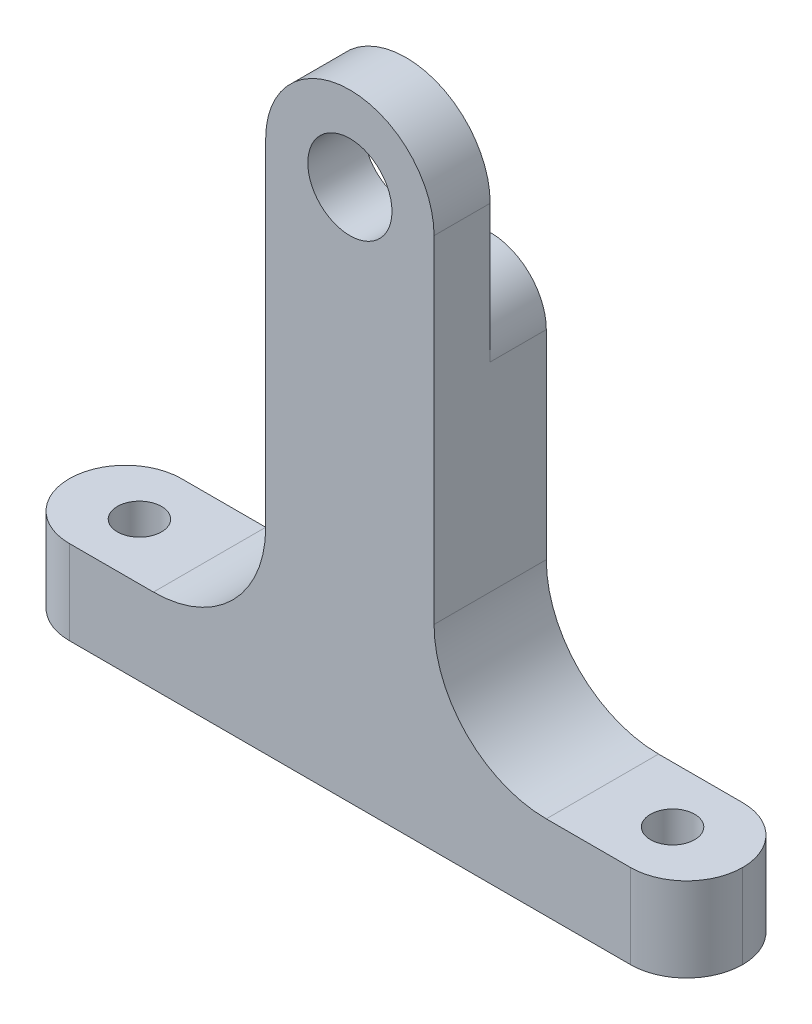
ISO-10303-21;
HEADER;
FILE_DESCRIPTION(('STEP AP214'),'2;1');
FILE_NAME('part.step','',(''),(''),'','','');
FILE_SCHEMA(('AUTOMOTIVE_DESIGN { 1 0 10303 214 1 1 1 1 }'));
ENDSEC;
DATA;
#1=APPLICATION_CONTEXT('core data for automotive mechanical design processes');
#2=APPLICATION_PROTOCOL_DEFINITION('international standard','automotive_design',2000,#1);
#3=PRODUCT_CONTEXT('',#1,'mechanical');
#4=PRODUCT('Part','Part','',(#3));
#5=PRODUCT_RELATED_PRODUCT_CATEGORY('part','',(#4));
#6=PRODUCT_DEFINITION_FORMATION('','',#4);
#7=PRODUCT_DEFINITION_CONTEXT('part definition',#1,'design');
#8=PRODUCT_DEFINITION('design','',#6,#7);
#9=PRODUCT_DEFINITION_SHAPE('','',#8);
#10=(LENGTH_UNIT() NAMED_UNIT(*) SI_UNIT(.MILLI.,.METRE.));
#11=(NAMED_UNIT(*) PLANE_ANGLE_UNIT() SI_UNIT($,.RADIAN.));
#12=(NAMED_UNIT(*) SI_UNIT($,.STERADIAN.) SOLID_ANGLE_UNIT());
#13=UNCERTAINTY_MEASURE_WITH_UNIT(LENGTH_MEASURE(1.E-05),#10,'distance_accuracy_value','');
#14=(GEOMETRIC_REPRESENTATION_CONTEXT(3) GLOBAL_UNCERTAINTY_ASSIGNED_CONTEXT((#13)) GLOBAL_UNIT_ASSIGNED_CONTEXT((#10,
#11,#12)) REPRESENTATION_CONTEXT('',''));
#15=CARTESIAN_POINT('',(0.,0.,0.));
#16=DIRECTION('',(0.,0.,1.));
#17=DIRECTION('',(1.,0.,0.));
#18=AXIS2_PLACEMENT_3D('',#15,#16,#17);
#19=CARTESIAN_POINT('',(9.525,0.,12.7));
#20=DIRECTION('',(1.,0.,0.));
#21=DIRECTION('',(0.,1.,0.));
#22=AXIS2_PLACEMENT_3D('',#19,#20,#21);
#23=PLANE('',#22);
#24=DIRECTION('',(0.,-1.,0.));
#25=VECTOR('',#24,1.);
#26=CARTESIAN_POINT('',(9.525,0.,0.));
#27=LINE('',#26,#25);
#28=CARTESIAN_POINT('',(9.525,-15.5542598666732,0.));
#29=VERTEX_POINT('',#28);
#30=CARTESIAN_POINT('',(9.525,-38.1,0.));
#31=VERTEX_POINT('',#30);
#32=EDGE_CURVE('E203',#29,#31,#27,.T.);
#33=ORIENTED_EDGE('',*,*,#32,.F.);
#34=DIRECTION('',(0.,0.,1.));
#35=VECTOR('',#34,1.);
#36=CARTESIAN_POINT('',(9.525,-15.5542598666732,6.35000000000002));
#37=LINE('',#36,#35);
#38=CARTESIAN_POINT('',(9.525,-15.5542598666732,6.35));
#39=VERTEX_POINT('',#38);
#40=EDGE_CURVE('E158',#29,#39,#37,.T.);
#41=ORIENTED_EDGE('',*,*,#40,.T.);
#42=DIRECTION('',(0.,1.,0.));
#43=VECTOR('',#42,1.);
#44=CARTESIAN_POINT('',(9.525,0.,6.35));
#45=LINE('',#44,#43);
#46=CARTESIAN_POINT('',(9.525,0.,6.35));
#47=VERTEX_POINT('',#46);
#48=EDGE_CURVE('E63',#39,#47,#45,.T.);
#49=ORIENTED_EDGE('',*,*,#48,.T.);
#50=DIRECTION('',(0.,0.,-1.));
#51=VECTOR('',#50,1.);
#52=CARTESIAN_POINT('',(9.525,0.,12.7));
#53=LINE('',#52,#51);
#54=CARTESIAN_POINT('',(9.525,0.,12.7));
#55=VERTEX_POINT('',#54);
#56=EDGE_CURVE('E155',#55,#47,#53,.T.);
#57=ORIENTED_EDGE('',*,*,#56,.F.);
#58=DIRECTION('',(0.,-1.,0.));
#59=VECTOR('',#58,1.);
#60=CARTESIAN_POINT('',(9.525,0.,12.7));
#61=LINE('',#60,#59);
#62=CARTESIAN_POINT('',(9.525,-38.1,12.7));
#63=VERTEX_POINT('',#62);
#64=EDGE_CURVE('E285',#55,#63,#61,.T.);
#65=ORIENTED_EDGE('',*,*,#64,.T.);
#66=DIRECTION('',(0.,0.,-1.));
#67=VECTOR('',#66,1.);
#68=CARTESIAN_POINT('',(9.525,-38.1,12.7));
#69=LINE('',#68,#67);
#70=EDGE_CURVE('E183',#63,#31,#69,.T.);
#71=ORIENTED_EDGE('',*,*,#70,.T.);
#72=EDGE_LOOP('',(#33,#41,#49,#57,#65,#71));
#73=FACE_BOUND('',#72,.T.);
#74=ADVANCED_FACE('F43',(#73),#23,.T.);
#75=CARTESIAN_POINT('',(0.,0.,12.7));
#76=DIRECTION('',(0.,0.,-1.));
#77=DIRECTION('',(-1.,0.,0.));
#78=AXIS2_PLACEMENT_3D('',#75,#76,#77);
#79=CYLINDRICAL_SURFACE('',#78,9.525);
#80=ORIENTED_EDGE('',*,*,#56,.T.);
#81=CARTESIAN_POINT('',(0.,0.,6.35));
#82=DIRECTION('',(0.,0.,1.));
#83=DIRECTION('',(1.,0.,0.));
#84=AXIS2_PLACEMENT_3D('',#81,#82,#83);
#85=CIRCLE('',#84,9.525);
#86=CARTESIAN_POINT('',(-9.525,0.,6.35));
#87=VERTEX_POINT('',#86);
#88=EDGE_CURVE('E163',#87,#47,#85,.F.);
#89=ORIENTED_EDGE('',*,*,#88,.F.);
#90=DIRECTION('',(0.,0.,-1.));
#91=VECTOR('',#90,1.);
#92=CARTESIAN_POINT('',(-9.525,0.,12.7));
#93=LINE('',#92,#91);
#94=CARTESIAN_POINT('',(-9.525,0.,12.7));
#95=VERTEX_POINT('',#94);
#96=EDGE_CURVE('E173',#95,#87,#93,.T.);
#97=ORIENTED_EDGE('',*,*,#96,.F.);
#98=CARTESIAN_POINT('',(0.,0.,12.7));
#99=DIRECTION('',(0.,0.,1.));
#100=DIRECTION('',(1.,0.,0.));
#101=AXIS2_PLACEMENT_3D('',#98,#99,#100);
#102=CIRCLE('',#101,9.525);
#103=EDGE_CURVE('E170',#55,#95,#102,.T.);
#104=ORIENTED_EDGE('',*,*,#103,.F.);
#105=EDGE_LOOP('',(#80,#89,#97,#104));
#106=FACE_BOUND('',#105,.T.);
#107=ADVANCED_FACE('F169',(#106),#79,.T.);
#108=CARTESIAN_POINT('',(-9.525,0.,12.7));
#109=DIRECTION('',(1.,0.,0.));
#110=DIRECTION('',(0.,1.,0.));
#111=AXIS2_PLACEMENT_3D('',#108,#109,#110);
#112=PLANE('',#111);
#113=DIRECTION('',(0.,-1.,0.));
#114=VECTOR('',#113,1.);
#115=CARTESIAN_POINT('',(-9.525,0.,6.35));
#116=LINE('',#115,#114);
#117=CARTESIAN_POINT('',(-9.525,-15.5542598666732,6.35));
#118=VERTEX_POINT('',#117);
#119=EDGE_CURVE('E58',#87,#118,#116,.T.);
#120=ORIENTED_EDGE('',*,*,#119,.T.);
#121=DIRECTION('',(0.,0.,-1.));
#122=VECTOR('',#121,1.);
#123=CARTESIAN_POINT('',(-9.525,-15.5542598666732,12.7));
#124=LINE('',#123,#122);
#125=CARTESIAN_POINT('',(-9.525,-15.5542598666732,0.));
#126=VERTEX_POINT('',#125);
#127=EDGE_CURVE('E242',#118,#126,#124,.T.);
#128=ORIENTED_EDGE('',*,*,#127,.T.);
#129=DIRECTION('',(0.,-1.,0.));
#130=VECTOR('',#129,1.);
#131=CARTESIAN_POINT('',(-9.525,0.,0.));
#132=LINE('',#131,#130);
#133=CARTESIAN_POINT('',(-9.525,-38.1,0.));
#134=VERTEX_POINT('',#133);
#135=EDGE_CURVE('E267',#126,#134,#132,.T.);
#136=ORIENTED_EDGE('',*,*,#135,.T.);
#137=DIRECTION('',(0.,0.,-1.));
#138=VECTOR('',#137,1.);
#139=CARTESIAN_POINT('',(-9.525,-38.1,12.7));
#140=LINE('',#139,#138);
#141=CARTESIAN_POINT('',(-9.525,-38.1,12.7));
#142=VERTEX_POINT('',#141);
#143=EDGE_CURVE('E176',#134,#142,#140,.F.);
#144=ORIENTED_EDGE('',*,*,#143,.T.);
#145=DIRECTION('',(0.,-1.,0.));
#146=VECTOR('',#145,1.);
#147=CARTESIAN_POINT('',(-9.525,0.,12.7));
#148=LINE('',#147,#146);
#149=EDGE_CURVE('E289',#95,#142,#148,.T.);
#150=ORIENTED_EDGE('',*,*,#149,.F.);
#151=ORIENTED_EDGE('',*,*,#96,.T.);
#152=EDGE_LOOP('',(#120,#128,#136,#144,#150,#151));
#153=FACE_BOUND('',#152,.T.);
#154=ADVANCED_FACE('F260',(#153),#112,.F.);
#155=CARTESIAN_POINT('',(0.,-50.8,12.7));
#156=DIRECTION('',(0.,-1.,0.));
#157=DIRECTION('',(1.,0.,0.));
#158=AXIS2_PLACEMENT_3D('',#155,#156,#157);
#159=PLANE('',#158);
#160=CARTESIAN_POINT('',(-30.1625,-50.8,6.35));
#161=DIRECTION('',(0.,1.,0.));
#162=DIRECTION('',(-1.,0.,0.));
#163=AXIS2_PLACEMENT_3D('',#160,#161,#162);
#164=CIRCLE('',#163,2.5);
#165=CARTESIAN_POINT('',(-32.6625,-50.8,6.35));
#166=VERTEX_POINT('',#165);
#167=EDGE_CURVE('E234',#166,#166,#164,.T.);
#168=ORIENTED_EDGE('',*,*,#167,.F.);
#169=EDGE_LOOP('',(#168));
#170=FACE_BOUND('',#169,.T.);
#171=CARTESIAN_POINT('',(-31.75,-50.8,6.35));
#172=DIRECTION('',(0.,-1.,0.));
#173=DIRECTION('',(1.,0.,0.));
#174=AXIS2_PLACEMENT_3D('',#171,#172,#173);
#175=CIRCLE('',#174,6.35);
#176=CARTESIAN_POINT('',(-31.75,-50.8,0.));
#177=VERTEX_POINT('',#176);
#178=CARTESIAN_POINT('',(-38.1,-50.8,6.35));
#179=VERTEX_POINT('',#178);
#180=EDGE_CURVE('E218',#177,#179,#175,.F.);
#181=ORIENTED_EDGE('',*,*,#180,.T.);
#182=CARTESIAN_POINT('',(-31.75,-50.8,6.35));
#183=DIRECTION('',(0.,-1.,0.));
#184=DIRECTION('',(1.,0.,0.));
#185=AXIS2_PLACEMENT_3D('',#182,#183,#184);
#186=CIRCLE('',#185,6.35);
#187=CARTESIAN_POINT('',(-31.75,-50.8,12.7));
#188=VERTEX_POINT('',#187);
#189=EDGE_CURVE('E220',#179,#188,#186,.F.);
#190=ORIENTED_EDGE('',*,*,#189,.T.);
#191=DIRECTION('',(-1.,0.,0.));
#192=VECTOR('',#191,1.);
#193=CARTESIAN_POINT('',(0.,-50.8,12.7));
#194=LINE('',#193,#192);
#195=CARTESIAN_POINT('',(-22.225,-50.8,12.7));
#196=VERTEX_POINT('',#195);
#197=EDGE_CURVE('E296',#196,#188,#194,.T.);
#198=ORIENTED_EDGE('',*,*,#197,.F.);
#199=DIRECTION('',(0.,0.,-1.));
#200=VECTOR('',#199,1.);
#201=CARTESIAN_POINT('',(-22.225,-50.8,0.));
#202=LINE('',#201,#200);
#203=CARTESIAN_POINT('',(-22.225,-50.8,0.));
#204=VERTEX_POINT('',#203);
#205=EDGE_CURVE('E172',#196,#204,#202,.T.);
#206=ORIENTED_EDGE('',*,*,#205,.T.);
#207=DIRECTION('',(-1.,0.,0.));
#208=VECTOR('',#207,1.);
#209=CARTESIAN_POINT('',(0.,-50.8,0.));
#210=LINE('',#209,#208);
#211=EDGE_CURVE('E275',#204,#177,#210,.T.);
#212=ORIENTED_EDGE('',*,*,#211,.T.);
#213=EDGE_LOOP('',(#181,#190,#198,#206,#212));
#214=FACE_BOUND('',#213,.T.);
#215=ADVANCED_FACE('F384',(#170,#214),#159,.F.);
#216=CARTESIAN_POINT('',(0.,-60.325,12.7));
#217=DIRECTION('',(0.,1.,0.));
#218=DIRECTION('',(0.,0.,1.));
#219=AXIS2_PLACEMENT_3D('',#216,#217,#218);
#220=PLANE('',#219);
#221=CARTESIAN_POINT('',(30.1625,-60.325,6.35));
#222=DIRECTION('',(0.,1.,0.));
#223=DIRECTION('',(0.,0.,1.));
#224=AXIS2_PLACEMENT_3D('',#221,#222,#223);
#225=CIRCLE('',#224,2.49999999999999);
#226=CARTESIAN_POINT('',(30.1625,-60.325,8.84999999999999));
#227=VERTEX_POINT('',#226);
#228=EDGE_CURVE('E204',#227,#227,#225,.T.);
#229=ORIENTED_EDGE('',*,*,#228,.T.);
#230=EDGE_LOOP('',(#229));
#231=FACE_BOUND('',#230,.T.);
#232=CARTESIAN_POINT('',(-30.1625,-60.325,6.35));
#233=DIRECTION('',(0.,1.,0.));
#234=DIRECTION('',(0.,0.,1.));
#235=AXIS2_PLACEMENT_3D('',#232,#233,#234);
#236=CIRCLE('',#235,2.5);
#237=CARTESIAN_POINT('',(-30.1625,-60.325,8.85));
#238=VERTEX_POINT('',#237);
#239=EDGE_CURVE('E200',#238,#238,#236,.T.);
#240=ORIENTED_EDGE('',*,*,#239,.T.);
#241=EDGE_LOOP('',(#240));
#242=FACE_BOUND('',#241,.T.);
#243=DIRECTION('',(1.,0.,0.));
#244=VECTOR('',#243,1.);
#245=CARTESIAN_POINT('',(0.,-60.325,12.7));
#246=LINE('',#245,#244);
#247=CARTESIAN_POINT('',(-31.75,-60.325,12.7));
#248=VERTEX_POINT('',#247);
#249=CARTESIAN_POINT('',(31.75,-60.325,12.7));
#250=VERTEX_POINT('',#249);
#251=EDGE_CURVE('E299',#248,#250,#246,.T.);
#252=ORIENTED_EDGE('',*,*,#251,.F.);
#253=CARTESIAN_POINT('',(-31.75,-60.325,6.35));
#254=DIRECTION('',(0.,1.,0.));
#255=DIRECTION('',(0.,0.,1.));
#256=AXIS2_PLACEMENT_3D('',#253,#254,#255);
#257=CIRCLE('',#256,6.35);
#258=CARTESIAN_POINT('',(-38.1,-60.325,6.35));
#259=VERTEX_POINT('',#258);
#260=EDGE_CURVE('E216',#248,#259,#257,.F.);
#261=ORIENTED_EDGE('',*,*,#260,.T.);
#262=CARTESIAN_POINT('',(-31.75,-60.325,6.35));
#263=DIRECTION('',(0.,1.,0.));
#264=DIRECTION('',(0.,0.,1.));
#265=AXIS2_PLACEMENT_3D('',#262,#263,#264);
#266=CIRCLE('',#265,6.35);
#267=CARTESIAN_POINT('',(-31.75,-60.325,0.));
#268=VERTEX_POINT('',#267);
#269=EDGE_CURVE('E214',#259,#268,#266,.F.);
#270=ORIENTED_EDGE('',*,*,#269,.T.);
#271=DIRECTION('',(1.,0.,0.));
#272=VECTOR('',#271,1.);
#273=CARTESIAN_POINT('',(0.,-60.325,0.));
#274=LINE('',#273,#272);
#275=CARTESIAN_POINT('',(31.75,-60.325,0.));
#276=VERTEX_POINT('',#275);
#277=EDGE_CURVE('E282',#268,#276,#274,.T.);
#278=ORIENTED_EDGE('',*,*,#277,.T.);
#279=CARTESIAN_POINT('',(31.75,-60.325,6.35));
#280=DIRECTION('',(0.,1.,0.));
#281=DIRECTION('',(0.,0.,1.));
#282=AXIS2_PLACEMENT_3D('',#279,#280,#281);
#283=CIRCLE('',#282,6.35);
#284=CARTESIAN_POINT('',(38.1,-60.325,6.35));
#285=VERTEX_POINT('',#284);
#286=EDGE_CURVE('E210',#276,#285,#283,.F.);
#287=ORIENTED_EDGE('',*,*,#286,.T.);
#288=CARTESIAN_POINT('',(31.75,-60.325,6.35));
#289=DIRECTION('',(0.,1.,0.));
#290=DIRECTION('',(0.,0.,1.));
#291=AXIS2_PLACEMENT_3D('',#288,#289,#290);
#292=CIRCLE('',#291,6.35);
#293=EDGE_CURVE('E212',#285,#250,#292,.F.);
#294=ORIENTED_EDGE('',*,*,#293,.T.);
#295=EDGE_LOOP('',(#252,#261,#270,#278,#287,#294));
#296=FACE_BOUND('',#295,.T.);
#297=ADVANCED_FACE('F381',(#231,#242,#296),#220,.F.);
#298=CARTESIAN_POINT('',(0.,-50.8,12.7));
#299=DIRECTION('',(0.,-1.,0.));
#300=DIRECTION('',(1.,0.,0.));
#301=AXIS2_PLACEMENT_3D('',#298,#299,#300);
#302=PLANE('',#301);
#303=CARTESIAN_POINT('',(30.1625,-50.8,6.35));
#304=DIRECTION('',(0.,1.,0.));
#305=DIRECTION('',(-1.,0.,0.));
#306=AXIS2_PLACEMENT_3D('',#303,#304,#305);
#307=CIRCLE('',#306,2.49999999999999);
#308=CARTESIAN_POINT('',(27.6625,-50.8,6.35));
#309=VERTEX_POINT('',#308);
#310=EDGE_CURVE('E419',#309,#309,#307,.T.);
#311=ORIENTED_EDGE('',*,*,#310,.F.);
#312=EDGE_LOOP('',(#311));
#313=FACE_BOUND('',#312,.T.);
#314=DIRECTION('',(-1.,0.,0.));
#315=VECTOR('',#314,1.);
#316=CARTESIAN_POINT('',(0.,-50.8,12.7));
#317=LINE('',#316,#315);
#318=CARTESIAN_POINT('',(31.75,-50.8,12.7));
#319=VERTEX_POINT('',#318);
#320=CARTESIAN_POINT('',(22.225,-50.8,12.7));
#321=VERTEX_POINT('',#320);
#322=EDGE_CURVE('E301',#319,#321,#317,.T.);
#323=ORIENTED_EDGE('',*,*,#322,.F.);
#324=CARTESIAN_POINT('',(31.75,-50.8,6.35));
#325=DIRECTION('',(0.,-1.,0.));
#326=DIRECTION('',(1.,0.,0.));
#327=AXIS2_PLACEMENT_3D('',#324,#325,#326);
#328=CIRCLE('',#327,6.35);
#329=CARTESIAN_POINT('',(38.1,-50.8,6.35));
#330=VERTEX_POINT('',#329);
#331=EDGE_CURVE('E228',#319,#330,#328,.F.);
#332=ORIENTED_EDGE('',*,*,#331,.T.);
#333=CARTESIAN_POINT('',(31.75,-50.8,6.35));
#334=DIRECTION('',(0.,-1.,0.));
#335=DIRECTION('',(1.,0.,0.));
#336=AXIS2_PLACEMENT_3D('',#333,#334,#335);
#337=CIRCLE('',#336,6.35);
#338=CARTESIAN_POINT('',(31.75,-50.8,0.));
#339=VERTEX_POINT('',#338);
#340=EDGE_CURVE('E226',#330,#339,#337,.F.);
#341=ORIENTED_EDGE('',*,*,#340,.T.);
#342=DIRECTION('',(-1.,0.,0.));
#343=VECTOR('',#342,1.);
#344=CARTESIAN_POINT('',(0.,-50.8,0.));
#345=LINE('',#344,#343);
#346=CARTESIAN_POINT('',(22.225,-50.8,0.));
#347=VERTEX_POINT('',#346);
#348=EDGE_CURVE('E284',#339,#347,#345,.T.);
#349=ORIENTED_EDGE('',*,*,#348,.T.);
#350=DIRECTION('',(0.,0.,-1.));
#351=VECTOR('',#350,1.);
#352=CARTESIAN_POINT('',(22.225,-50.8,12.7));
#353=LINE('',#352,#351);
#354=EDGE_CURVE('E186',#347,#321,#353,.F.);
#355=ORIENTED_EDGE('',*,*,#354,.T.);
#356=EDGE_LOOP('',(#323,#332,#341,#349,#355));
#357=FACE_BOUND('',#356,.T.);
#358=ADVANCED_FACE('F320',(#313,#357),#302,.F.);
#359=CARTESIAN_POINT('',(0.,0.,12.7));
#360=DIRECTION('',(0.,0.,-1.));
#361=DIRECTION('',(-1.,0.,0.));
#362=AXIS2_PLACEMENT_3D('',#359,#360,#361);
#363=CYLINDRICAL_SURFACE('',#362,4.7625);
#364=CARTESIAN_POINT('',(0.,0.,6.35));
#365=DIRECTION('',(0.,0.,1.));
#366=DIRECTION('',(1.,0.,0.));
#367=AXIS2_PLACEMENT_3D('',#364,#365,#366);
#368=CIRCLE('',#367,4.7625);
#369=CARTESIAN_POINT('',(4.7625,0.,6.35));
#370=VERTEX_POINT('',#369);
#371=EDGE_CURVE('E238',#370,#370,#368,.T.);
#372=ORIENTED_EDGE('',*,*,#371,.F.);
#373=EDGE_LOOP('',(#372));
#374=FACE_BOUND('',#373,.T.);
#375=CARTESIAN_POINT('',(0.,0.,12.7));
#376=DIRECTION('',(0.,0.,1.));
#377=DIRECTION('',(1.,0.,0.));
#378=AXIS2_PLACEMENT_3D('',#375,#376,#377);
#379=CIRCLE('',#378,4.7625);
#380=CARTESIAN_POINT('',(4.7625,0.,12.7));
#381=VERTEX_POINT('',#380);
#382=EDGE_CURVE('E178',#381,#381,#379,.T.);
#383=ORIENTED_EDGE('',*,*,#382,.T.);
#384=EDGE_LOOP('',(#383));
#385=FACE_BOUND('',#384,.T.);
#386=ADVANCED_FACE('F307',(#374,#385),#363,.F.);
#387=CARTESIAN_POINT('',(0.,0.,12.7));
#388=DIRECTION('',(0.,0.,1.));
#389=DIRECTION('',(1.,0.,0.));
#390=AXIS2_PLACEMENT_3D('',#387,#388,#389);
#391=PLANE('',#390);
#392=ORIENTED_EDGE('',*,*,#197,.T.);
#393=DIRECTION('',(0.,-1.,0.));
#394=VECTOR('',#393,1.);
#395=CARTESIAN_POINT('',(-31.75,-60.325,12.7));
#396=LINE('',#395,#394);
#397=EDGE_CURVE('E207',#188,#248,#396,.T.);
#398=ORIENTED_EDGE('',*,*,#397,.T.);
#399=ORIENTED_EDGE('',*,*,#251,.T.);
#400=DIRECTION('',(0.,1.,0.));
#401=VECTOR('',#400,1.);
#402=CARTESIAN_POINT('',(31.75,-50.8,12.7));
#403=LINE('',#402,#401);
#404=EDGE_CURVE('E199',#250,#319,#403,.T.);
#405=ORIENTED_EDGE('',*,*,#404,.T.);
#406=ORIENTED_EDGE('',*,*,#322,.T.);
#407=CARTESIAN_POINT('',(22.225,-38.1,12.7));
#408=DIRECTION('',(0.,0.,1.));
#409=DIRECTION('',(1.,0.,0.));
#410=AXIS2_PLACEMENT_3D('',#407,#408,#409);
#411=CIRCLE('',#410,12.7);
#412=EDGE_CURVE('E197',#321,#63,#411,.F.);
#413=ORIENTED_EDGE('',*,*,#412,.T.);
#414=ORIENTED_EDGE('',*,*,#64,.F.);
#415=ORIENTED_EDGE('',*,*,#103,.T.);
#416=ORIENTED_EDGE('',*,*,#149,.T.);
#417=CARTESIAN_POINT('',(-22.225,-38.1,12.7));
#418=DIRECTION('',(0.,0.,1.));
#419=DIRECTION('',(1.,0.,0.));
#420=AXIS2_PLACEMENT_3D('',#417,#418,#419);
#421=CIRCLE('',#420,12.7);
#422=EDGE_CURVE('E192',#142,#196,#421,.F.);
#423=ORIENTED_EDGE('',*,*,#422,.T.);
#424=EDGE_LOOP('',(#392,#398,#399,#405,#406,#413,#414,#415,#416,#423));
#425=FACE_BOUND('',#424,.T.);
#426=ORIENTED_EDGE('',*,*,#382,.F.);
#427=EDGE_LOOP('',(#426));
#428=FACE_BOUND('',#427,.T.);
#429=ADVANCED_FACE('F309',(#425,#428),#391,.T.);
#430=CARTESIAN_POINT('',(0.,0.,0.));
#431=DIRECTION('',(0.,0.,1.));
#432=DIRECTION('',(1.,0.,0.));
#433=AXIS2_PLACEMENT_3D('',#430,#431,#432);
#434=PLANE('',#433);
#435=ORIENTED_EDGE('',*,*,#135,.F.);
#436=CARTESIAN_POINT('',(-3.175,-15.5542598666732,0.));
#437=DIRECTION('',(0.,0.,1.));
#438=DIRECTION('',(1.,0.,0.));
#439=AXIS2_PLACEMENT_3D('',#436,#437,#438);
#440=CIRCLE('',#439,6.35);
#441=CARTESIAN_POINT('',(-1.905,-9.33255592000391,0.));
#442=VERTEX_POINT('',#441);
#443=EDGE_CURVE('E247',#126,#442,#440,.F.);
#444=ORIENTED_EDGE('',*,*,#443,.T.);
#445=CARTESIAN_POINT('',(0.,0.,0.));
#446=DIRECTION('',(0.,0.,1.));
#447=DIRECTION('',(1.,0.,0.));
#448=AXIS2_PLACEMENT_3D('',#445,#446,#447);
#449=CIRCLE('',#448,9.525);
#450=CARTESIAN_POINT('',(1.905,-9.33255592000391,0.));
#451=VERTEX_POINT('',#450);
#452=EDGE_CURVE('E230',#442,#451,#449,.T.);
#453=ORIENTED_EDGE('',*,*,#452,.T.);
#454=CARTESIAN_POINT('',(3.175,-15.5542598666732,0.));
#455=DIRECTION('',(0.,0.,1.));
#456=DIRECTION('',(1.,0.,0.));
#457=AXIS2_PLACEMENT_3D('',#454,#455,#456);
#458=CIRCLE('',#457,6.35);
#459=EDGE_CURVE('E245',#451,#29,#458,.F.);
#460=ORIENTED_EDGE('',*,*,#459,.T.);
#461=ORIENTED_EDGE('',*,*,#32,.T.);
#462=CARTESIAN_POINT('',(22.225,-38.1,0.));
#463=DIRECTION('',(0.,0.,1.));
#464=DIRECTION('',(1.,0.,0.));
#465=AXIS2_PLACEMENT_3D('',#462,#463,#464);
#466=CIRCLE('',#465,12.7);
#467=EDGE_CURVE('E194',#31,#347,#466,.T.);
#468=ORIENTED_EDGE('',*,*,#467,.T.);
#469=ORIENTED_EDGE('',*,*,#348,.F.);
#470=DIRECTION('',(0.,1.,0.));
#471=VECTOR('',#470,1.);
#472=CARTESIAN_POINT('',(31.75,0.,0.));
#473=LINE('',#472,#471);
#474=EDGE_CURVE('E222',#339,#276,#473,.F.);
#475=ORIENTED_EDGE('',*,*,#474,.T.);
#476=ORIENTED_EDGE('',*,*,#277,.F.);
#477=DIRECTION('',(0.,-1.,0.));
#478=VECTOR('',#477,1.);
#479=CARTESIAN_POINT('',(-31.75,0.,0.));
#480=LINE('',#479,#478);
#481=EDGE_CURVE('E224',#268,#177,#480,.F.);
#482=ORIENTED_EDGE('',*,*,#481,.T.);
#483=ORIENTED_EDGE('',*,*,#211,.F.);
#484=CARTESIAN_POINT('',(-22.225,-38.1,0.));
#485=DIRECTION('',(0.,0.,1.));
#486=DIRECTION('',(1.,0.,0.));
#487=AXIS2_PLACEMENT_3D('',#484,#485,#486);
#488=CIRCLE('',#487,12.7);
#489=EDGE_CURVE('E189',#204,#134,#488,.T.);
#490=ORIENTED_EDGE('',*,*,#489,.T.);
#491=EDGE_LOOP('',(#435,#444,#453,#460,#461,#468,#469,#475,#476,#482,#483,#490));
#492=FACE_BOUND('',#491,.T.);
#493=ADVANCED_FACE('F266',(#492),#434,.F.);
#494=CARTESIAN_POINT('',(-22.225,-38.1,12.7));
#495=DIRECTION('',(0.,0.,1.));
#496=DIRECTION('',(1.,0.,0.));
#497=AXIS2_PLACEMENT_3D('',#494,#495,#496);
#498=CYLINDRICAL_SURFACE('',#497,12.7);
#499=ORIENTED_EDGE('',*,*,#422,.F.);
#500=ORIENTED_EDGE('',*,*,#143,.F.);
#501=ORIENTED_EDGE('',*,*,#489,.F.);
#502=ORIENTED_EDGE('',*,*,#205,.F.);
#503=EDGE_LOOP('',(#499,#500,#501,#502));
#504=FACE_BOUND('',#503,.T.);
#505=ADVANCED_FACE('F317',(#504),#498,.F.);
#506=CARTESIAN_POINT('',(22.225,-38.1,12.7));
#507=DIRECTION('',(0.,0.,-1.));
#508=DIRECTION('',(-1.,0.,0.));
#509=AXIS2_PLACEMENT_3D('',#506,#507,#508);
#510=CYLINDRICAL_SURFACE('',#509,12.7);
#511=ORIENTED_EDGE('',*,*,#412,.F.);
#512=ORIENTED_EDGE('',*,*,#354,.F.);
#513=ORIENTED_EDGE('',*,*,#467,.F.);
#514=ORIENTED_EDGE('',*,*,#70,.F.);
#515=EDGE_LOOP('',(#511,#512,#513,#514));
#516=FACE_BOUND('',#515,.T.);
#517=ADVANCED_FACE('F335',(#516),#510,.F.);
#518=CARTESIAN_POINT('',(30.1625,-86.36,6.35));
#519=DIRECTION('',(0.,1.,0.));
#520=DIRECTION('',(-1.,0.,0.));
#521=AXIS2_PLACEMENT_3D('',#518,#519,#520);
#522=CYLINDRICAL_SURFACE('',#521,2.49999999999999);
#523=ORIENTED_EDGE('',*,*,#310,.T.);
#524=EDGE_LOOP('',(#523));
#525=FACE_BOUND('',#524,.T.);
#526=ORIENTED_EDGE('',*,*,#228,.F.);
#527=EDGE_LOOP('',(#526));
#528=FACE_BOUND('',#527,.T.);
#529=ADVANCED_FACE('F339',(#525,#528),#522,.F.);
#530=CARTESIAN_POINT('',(-30.1625,-86.36,6.35));
#531=DIRECTION('',(0.,1.,0.));
#532=DIRECTION('',(-1.,0.,0.));
#533=AXIS2_PLACEMENT_3D('',#530,#531,#532);
#534=CYLINDRICAL_SURFACE('',#533,2.5);
#535=ORIENTED_EDGE('',*,*,#167,.T.);
#536=EDGE_LOOP('',(#535));
#537=FACE_BOUND('',#536,.T.);
#538=ORIENTED_EDGE('',*,*,#239,.F.);
#539=EDGE_LOOP('',(#538));
#540=FACE_BOUND('',#539,.T.);
#541=ADVANCED_FACE('F348',(#537,#540),#534,.F.);
#542=CARTESIAN_POINT('',(-31.75,0.,6.35));
#543=DIRECTION('',(0.,-1.,0.));
#544=DIRECTION('',(0.,0.,-1.));
#545=AXIS2_PLACEMENT_3D('',#542,#543,#544);
#546=CYLINDRICAL_SURFACE('',#545,6.35);
#547=DIRECTION('',(0.,-1.,0.));
#548=VECTOR('',#547,1.);
#549=CARTESIAN_POINT('',(-38.1,0.,6.35));
#550=LINE('',#549,#548);
#551=EDGE_CURVE('E231',#179,#259,#550,.T.);
#552=ORIENTED_EDGE('',*,*,#551,.F.);
#553=ORIENTED_EDGE('',*,*,#180,.F.);
#554=ORIENTED_EDGE('',*,*,#481,.F.);
#555=ORIENTED_EDGE('',*,*,#269,.F.);
#556=EDGE_LOOP('',(#552,#553,#554,#555));
#557=FACE_BOUND('',#556,.T.);
#558=ADVANCED_FACE('F345',(#557),#546,.T.);
#559=CARTESIAN_POINT('',(-31.75,0.,6.35));
#560=DIRECTION('',(0.,1.,0.));
#561=DIRECTION('',(0.,0.,1.));
#562=AXIS2_PLACEMENT_3D('',#559,#560,#561);
#563=CYLINDRICAL_SURFACE('',#562,6.35);
#564=ORIENTED_EDGE('',*,*,#189,.F.);
#565=ORIENTED_EDGE('',*,*,#551,.T.);
#566=ORIENTED_EDGE('',*,*,#260,.F.);
#567=ORIENTED_EDGE('',*,*,#397,.F.);
#568=EDGE_LOOP('',(#564,#565,#566,#567));
#569=FACE_BOUND('',#568,.T.);
#570=ADVANCED_FACE('F341',(#569),#563,.T.);
#571=CARTESIAN_POINT('',(31.75,0.,6.35));
#572=DIRECTION('',(0.,1.,0.));
#573=DIRECTION('',(0.,0.,1.));
#574=AXIS2_PLACEMENT_3D('',#571,#572,#573);
#575=CYLINDRICAL_SURFACE('',#574,6.35);
#576=DIRECTION('',(0.,1.,0.));
#577=VECTOR('',#576,1.);
#578=CARTESIAN_POINT('',(38.1,0.,6.35));
#579=LINE('',#578,#577);
#580=EDGE_CURVE('E235',#285,#330,#579,.T.);
#581=ORIENTED_EDGE('',*,*,#580,.F.);
#582=ORIENTED_EDGE('',*,*,#286,.F.);
#583=ORIENTED_EDGE('',*,*,#474,.F.);
#584=ORIENTED_EDGE('',*,*,#340,.F.);
#585=EDGE_LOOP('',(#581,#582,#583,#584));
#586=FACE_BOUND('',#585,.T.);
#587=ADVANCED_FACE('F344',(#586),#575,.T.);
#588=CARTESIAN_POINT('',(31.75,0.,6.35));
#589=DIRECTION('',(0.,-1.,0.));
#590=DIRECTION('',(0.,0.,-1.));
#591=AXIS2_PLACEMENT_3D('',#588,#589,#590);
#592=CYLINDRICAL_SURFACE('',#591,6.35);
#593=ORIENTED_EDGE('',*,*,#293,.F.);
#594=ORIENTED_EDGE('',*,*,#580,.T.);
#595=ORIENTED_EDGE('',*,*,#331,.F.);
#596=ORIENTED_EDGE('',*,*,#404,.F.);
#597=EDGE_LOOP('',(#593,#594,#595,#596));
#598=FACE_BOUND('',#597,.T.);
#599=ADVANCED_FACE('F350',(#598),#592,.T.);
#600=CARTESIAN_POINT('',(0.,0.,39.6407683632075));
#601=DIRECTION('',(0.,0.,-1.));
#602=DIRECTION('',(-1.,0.,0.));
#603=AXIS2_PLACEMENT_3D('',#600,#601,#602);
#604=CYLINDRICAL_SURFACE('',#603,9.525);
#605=ORIENTED_EDGE('',*,*,#452,.F.);
#606=DIRECTION('',(0.,0.,-1.));
#607=VECTOR('',#606,1.);
#608=CARTESIAN_POINT('',(-1.905,-9.33255592000391,39.6407683632075));
#609=LINE('',#608,#607);
#610=CARTESIAN_POINT('',(-1.905,-9.33255592000391,6.35));
#611=VERTEX_POINT('',#610);
#612=EDGE_CURVE('E160',#442,#611,#609,.F.);
#613=ORIENTED_EDGE('',*,*,#612,.T.);
#614=CARTESIAN_POINT('',(1.905,-9.33255592000391,6.35));
#615=VERTEX_POINT('',#614);
#616=EDGE_CURVE('E167',#615,#611,#85,.F.);
#617=ORIENTED_EDGE('',*,*,#616,.F.);
#618=DIRECTION('',(0.,0.,-1.));
#619=VECTOR('',#618,1.);
#620=CARTESIAN_POINT('',(1.905,-9.33255592000391,39.6407683632075));
#621=LINE('',#620,#619);
#622=EDGE_CURVE('E249',#615,#451,#621,.T.);
#623=ORIENTED_EDGE('',*,*,#622,.T.);
#624=EDGE_LOOP('',(#605,#613,#617,#623));
#625=FACE_BOUND('',#624,.T.);
#626=ADVANCED_FACE('F269',(#625),#604,.F.);
#627=CARTESIAN_POINT('',(0.,0.,6.35));
#628=DIRECTION('',(0.,0.,1.));
#629=DIRECTION('',(1.,0.,0.));
#630=AXIS2_PLACEMENT_3D('',#627,#628,#629);
#631=PLANE('',#630);
#632=ORIENTED_EDGE('',*,*,#371,.T.);
#633=EDGE_LOOP('',(#632));
#634=FACE_BOUND('',#633,.T.);
#635=ORIENTED_EDGE('',*,*,#88,.T.);
#636=ORIENTED_EDGE('',*,*,#48,.F.);
#637=CARTESIAN_POINT('',(3.175,-15.5542598666732,6.35));
#638=DIRECTION('',(0.,0.,1.));
#639=DIRECTION('',(1.,0.,0.));
#640=AXIS2_PLACEMENT_3D('',#637,#638,#639);
#641=CIRCLE('',#640,6.35);
#642=EDGE_CURVE('E12',#39,#615,#641,.T.);
#643=ORIENTED_EDGE('',*,*,#642,.T.);
#644=ORIENTED_EDGE('',*,*,#616,.T.);
#645=CARTESIAN_POINT('',(-3.175,-15.5542598666732,6.35));
#646=DIRECTION('',(0.,0.,1.));
#647=DIRECTION('',(1.,0.,0.));
#648=AXIS2_PLACEMENT_3D('',#645,#646,#647);
#649=CIRCLE('',#648,6.35);
#650=EDGE_CURVE('E51',#611,#118,#649,.T.);
#651=ORIENTED_EDGE('',*,*,#650,.T.);
#652=ORIENTED_EDGE('',*,*,#119,.F.);
#653=EDGE_LOOP('',(#635,#636,#643,#644,#651,#652));
#654=FACE_BOUND('',#653,.T.);
#655=ADVANCED_FACE('F164',(#634,#654),#631,.F.);
#656=CARTESIAN_POINT('',(-3.175,-15.5542598666732,39.6407683632075));
#657=DIRECTION('',(0.,0.,-1.));
#658=DIRECTION('',(-1.,0.,0.));
#659=AXIS2_PLACEMENT_3D('',#656,#657,#658);
#660=CYLINDRICAL_SURFACE('',#659,6.35);
#661=ORIENTED_EDGE('',*,*,#650,.F.);
#662=ORIENTED_EDGE('',*,*,#612,.F.);
#663=ORIENTED_EDGE('',*,*,#443,.F.);
#664=ORIENTED_EDGE('',*,*,#127,.F.);
#665=EDGE_LOOP('',(#661,#662,#663,#664));
#666=FACE_BOUND('',#665,.T.);
#667=ADVANCED_FACE('F263',(#666),#660,.T.);
#668=CARTESIAN_POINT('',(3.175,-15.5542598666732,39.6407683632075));
#669=DIRECTION('',(0.,0.,-1.));
#670=DIRECTION('',(-1.,0.,0.));
#671=AXIS2_PLACEMENT_3D('',#668,#669,#670);
#672=CYLINDRICAL_SURFACE('',#671,6.35);
#673=ORIENTED_EDGE('',*,*,#642,.F.);
#674=ORIENTED_EDGE('',*,*,#40,.F.);
#675=ORIENTED_EDGE('',*,*,#459,.F.);
#676=ORIENTED_EDGE('',*,*,#622,.F.);
#677=EDGE_LOOP('',(#673,#674,#675,#676));
#678=FACE_BOUND('',#677,.T.);
#679=ADVANCED_FACE('F45',(#678),#672,.T.);
#680=CLOSED_SHELL('',(#74,#107,#154,#215,#297,#358,#386,#429,#493,#505,#517,#529,#541,#558,#570,
#587,#599,#626,#655,#667,#679));
#681=MANIFOLD_SOLID_BREP('B2',#680);
#682=ADVANCED_BREP_SHAPE_REPRESENTATION('',(#18,#681),#14);
#683=SHAPE_DEFINITION_REPRESENTATION(#9,#682);
ENDSEC;
END-ISO-10303-21;
